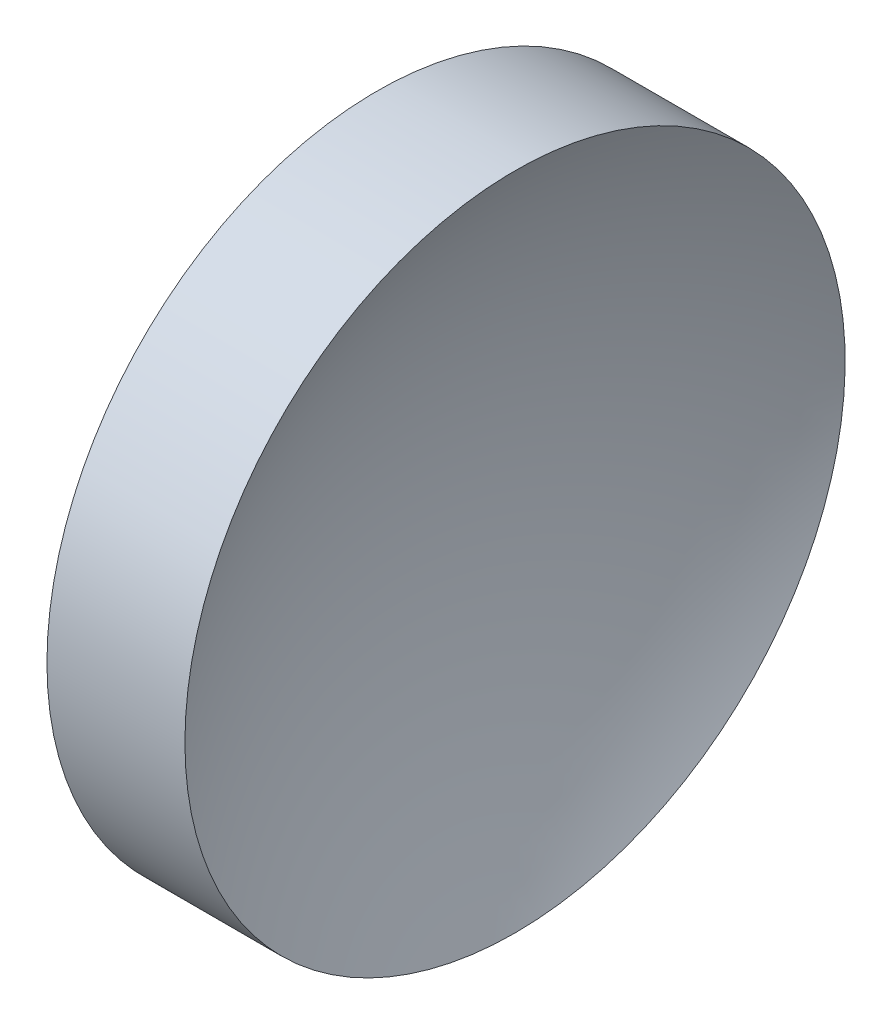
ISO-10303-21;
HEADER;
FILE_DESCRIPTION(('STEP AP214'),'2;1');
FILE_NAME('part.step','',(''),(''),'','','');
FILE_SCHEMA(('AUTOMOTIVE_DESIGN { 1 0 10303 214 1 1 1 1 }'));
ENDSEC;
DATA;
#1=APPLICATION_CONTEXT('core data for automotive mechanical design processes');
#2=APPLICATION_PROTOCOL_DEFINITION('international standard','automotive_design',2000,#1);
#3=PRODUCT_CONTEXT('',#1,'mechanical');
#4=PRODUCT('Part','Part','',(#3));
#5=PRODUCT_RELATED_PRODUCT_CATEGORY('part','',(#4));
#6=PRODUCT_DEFINITION_FORMATION('','',#4);
#7=PRODUCT_DEFINITION_CONTEXT('part definition',#1,'design');
#8=PRODUCT_DEFINITION('design','',#6,#7);
#9=PRODUCT_DEFINITION_SHAPE('','',#8);
#10=(LENGTH_UNIT() NAMED_UNIT(*) SI_UNIT(.MILLI.,.METRE.));
#11=(NAMED_UNIT(*) PLANE_ANGLE_UNIT() SI_UNIT($,.RADIAN.));
#12=(NAMED_UNIT(*) SI_UNIT($,.STERADIAN.) SOLID_ANGLE_UNIT());
#13=UNCERTAINTY_MEASURE_WITH_UNIT(LENGTH_MEASURE(1.E-05),#10,'distance_accuracy_value','');
#14=(GEOMETRIC_REPRESENTATION_CONTEXT(3) GLOBAL_UNCERTAINTY_ASSIGNED_CONTEXT((#13)) GLOBAL_UNIT_ASSIGNED_CONTEXT((#10,
#11,#12)) REPRESENTATION_CONTEXT('',''));
#15=CARTESIAN_POINT('',(0.,0.,0.));
#16=DIRECTION('',(0.,0.,1.));
#17=DIRECTION('',(1.,0.,0.));
#18=AXIS2_PLACEMENT_3D('',#15,#16,#17);
#19=CARTESIAN_POINT('',(85.3723370525261,32.6107681292268,0.));
#20=DIRECTION('',(-1.,0.,0.));
#21=DIRECTION('',(0.,-1.,0.));
#22=AXIS2_PLACEMENT_3D('',#19,#20,#21);
#23=SPHERICAL_SURFACE('',#22,25.84);
#24=CARTESIAN_POINT('',(62.7569529080991,32.6107681292268,0.));
#25=DIRECTION('',(-1.,0.,0.));
#26=DIRECTION('',(0.,0.,1.));
#27=AXIS2_PLACEMENT_3D('',#24,#25,#26);
#28=CIRCLE('',#27,12.5);
#29=CARTESIAN_POINT('',(62.7569529080991,32.6107681292268,12.5));
#30=VERTEX_POINT('',#29);
#31=EDGE_CURVE('E10',#30,#30,#28,.T.);
#32=ORIENTED_EDGE('',*,*,#31,.F.);
#33=EDGE_LOOP('',(#32));
#34=FACE_BOUND('',#33,.T.);
#35=ADVANCED_FACE('F35',(#34),#23,.F.);
#36=CARTESIAN_POINT('',(56.1009150799972,32.6107681292268,0.));
#37=DIRECTION('',(-1.,0.,0.));
#38=DIRECTION('',(0.,0.,1.));
#39=AXIS2_PLACEMENT_3D('',#36,#37,#38);
#40=CYLINDRICAL_SURFACE('',#39,12.5);
#41=CARTESIAN_POINT('',(57.5323370525261,32.6107681292268,0.));
#42=DIRECTION('',(-1.,0.,0.));
#43=DIRECTION('',(0.,0.,1.));
#44=AXIS2_PLACEMENT_3D('',#41,#42,#43);
#45=CIRCLE('',#44,12.5);
#46=CARTESIAN_POINT('',(57.5323370525261,32.6107681292268,12.5));
#47=VERTEX_POINT('',#46);
#48=EDGE_CURVE('E41',#47,#47,#45,.T.);
#49=ORIENTED_EDGE('',*,*,#48,.F.);
#50=EDGE_LOOP('',(#49));
#51=FACE_BOUND('',#50,.T.);
#52=ORIENTED_EDGE('',*,*,#31,.T.);
#53=EDGE_LOOP('',(#52));
#54=FACE_BOUND('',#53,.T.);
#55=ADVANCED_FACE('F49',(#51,#54),#40,.T.);
#56=CARTESIAN_POINT('',(57.5323370525261,32.6107681292268,0.));
#57=DIRECTION('',(1.,0.,0.));
#58=DIRECTION('',(0.,0.,-1.));
#59=AXIS2_PLACEMENT_3D('',#56,#57,#58);
#60=PLANE('',#59);
#61=ORIENTED_EDGE('',*,*,#48,.T.);
#62=EDGE_LOOP('',(#61));
#63=FACE_BOUND('',#62,.T.);
#64=ADVANCED_FACE('F47',(#63),#60,.F.);
#65=CLOSED_SHELL('',(#35,#55,#64));
#66=MANIFOLD_SOLID_BREP('B2',#65);
#67=ADVANCED_BREP_SHAPE_REPRESENTATION('',(#18,#66),#14);
#68=SHAPE_DEFINITION_REPRESENTATION(#9,#67);
ENDSEC;
END-ISO-10303-21;
